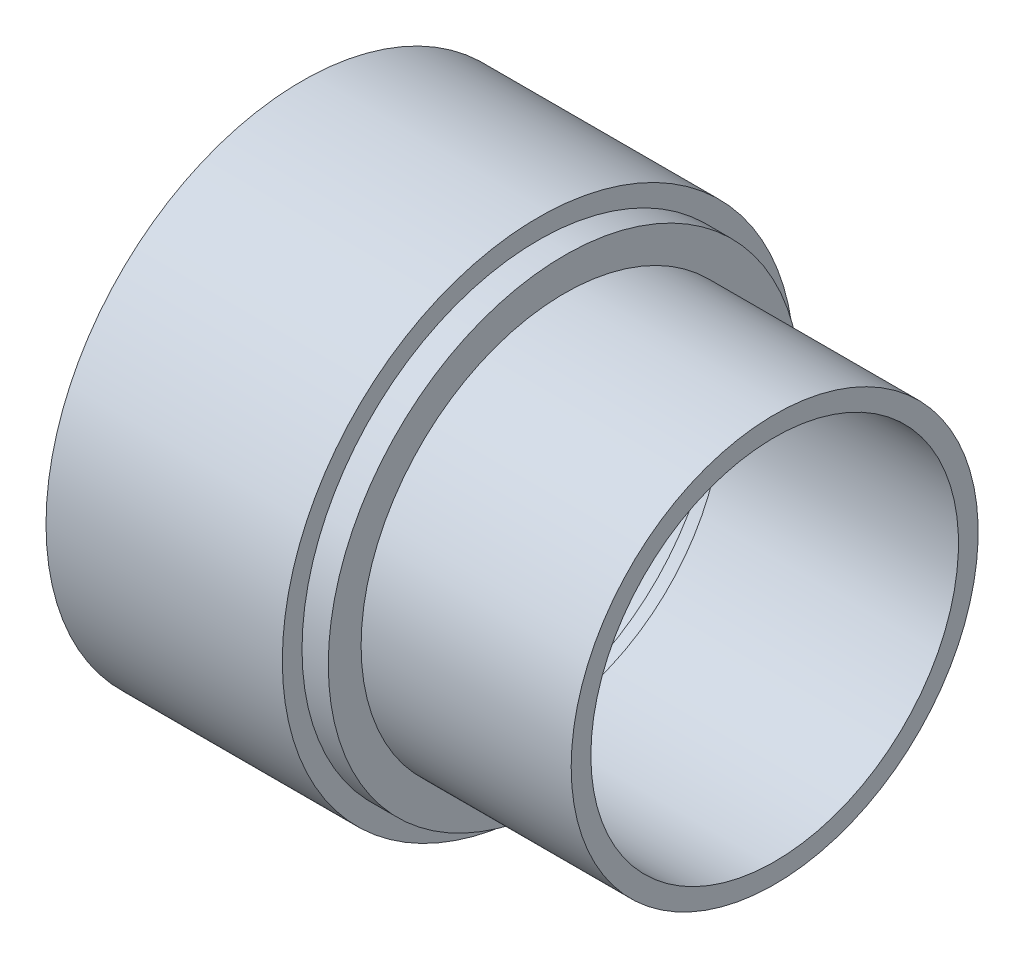
ISO-10303-21;
HEADER;
FILE_DESCRIPTION(('STEP AP214'),'2;1');
FILE_NAME('part.step','',(''),(''),'','','');
FILE_SCHEMA(('AUTOMOTIVE_DESIGN { 1 0 10303 214 1 1 1 1 }'));
ENDSEC;
DATA;
#1=APPLICATION_CONTEXT('core data for automotive mechanical design processes');
#2=APPLICATION_PROTOCOL_DEFINITION('international standard','automotive_design',2000,#1);
#3=PRODUCT_CONTEXT('',#1,'mechanical');
#4=PRODUCT('Part','Part','',(#3));
#5=PRODUCT_RELATED_PRODUCT_CATEGORY('part','',(#4));
#6=PRODUCT_DEFINITION_FORMATION('','',#4);
#7=PRODUCT_DEFINITION_CONTEXT('part definition',#1,'design');
#8=PRODUCT_DEFINITION('design','',#6,#7);
#9=PRODUCT_DEFINITION_SHAPE('','',#8);
#10=(LENGTH_UNIT() NAMED_UNIT(*) SI_UNIT(.MILLI.,.METRE.));
#11=(NAMED_UNIT(*) PLANE_ANGLE_UNIT() SI_UNIT($,.RADIAN.));
#12=(NAMED_UNIT(*) SI_UNIT($,.STERADIAN.) SOLID_ANGLE_UNIT());
#13=UNCERTAINTY_MEASURE_WITH_UNIT(LENGTH_MEASURE(1.E-05),#10,'distance_accuracy_value','');
#14=(GEOMETRIC_REPRESENTATION_CONTEXT(3) GLOBAL_UNCERTAINTY_ASSIGNED_CONTEXT((#13)) GLOBAL_UNIT_ASSIGNED_CONTEXT((#10,
#11,#12)) REPRESENTATION_CONTEXT('',''));
#15=CARTESIAN_POINT('',(0.,0.,0.));
#16=DIRECTION('',(0.,0.,1.));
#17=DIRECTION('',(1.,0.,0.));
#18=AXIS2_PLACEMENT_3D('',#15,#16,#17);
#19=CARTESIAN_POINT('',(0.,49.2125,0.));
#20=DIRECTION('',(1.,0.,0.));
#21=DIRECTION('',(0.,0.,-1.));
#22=AXIS2_PLACEMENT_3D('',#19,#20,#21);
#23=PLANE('',#22);
#24=CARTESIAN_POINT('',(0.,0.,0.));
#25=DIRECTION('',(-1.,0.,0.));
#26=DIRECTION('',(0.,0.,1.));
#27=AXIS2_PLACEMENT_3D('',#24,#25,#26);
#28=CIRCLE('',#27,44.45);
#29=CARTESIAN_POINT('',(0.,0.,44.45));
#30=VERTEX_POINT('',#29);
#31=EDGE_CURVE('E11',#30,#30,#28,.T.);
#32=ORIENTED_EDGE('',*,*,#31,.F.);
#33=EDGE_LOOP('',(#32));
#34=FACE_BOUND('',#33,.T.);
#35=CARTESIAN_POINT('',(0.,0.,0.));
#36=DIRECTION('',(-1.,0.,0.));
#37=DIRECTION('',(0.,0.,1.));
#38=AXIS2_PLACEMENT_3D('',#35,#36,#37);
#39=CIRCLE('',#38,49.2125);
#40=CARTESIAN_POINT('',(0.,0.,49.2125));
#41=VERTEX_POINT('',#40);
#42=EDGE_CURVE('E62',#41,#41,#39,.T.);
#43=ORIENTED_EDGE('',*,*,#42,.T.);
#44=EDGE_LOOP('',(#43));
#45=FACE_BOUND('',#44,.T.);
#46=ADVANCED_FACE('F48',(#34,#45),#23,.F.);
#47=CARTESIAN_POINT('',(0.,0.,0.));
#48=DIRECTION('',(-1.,0.,0.));
#49=DIRECTION('',(0.,0.,1.));
#50=AXIS2_PLACEMENT_3D('',#47,#48,#49);
#51=CYLINDRICAL_SURFACE('',#50,44.45);
#52=CARTESIAN_POINT('',(57.15,0.,0.));
#53=DIRECTION('',(-1.,0.,0.));
#54=DIRECTION('',(0.,0.,1.));
#55=AXIS2_PLACEMENT_3D('',#52,#53,#54);
#56=CIRCLE('',#55,44.45);
#57=CARTESIAN_POINT('',(57.15,0.,44.45));
#58=VERTEX_POINT('',#57);
#59=EDGE_CURVE('E54',#58,#58,#56,.T.);
#60=ORIENTED_EDGE('',*,*,#59,.F.);
#61=EDGE_LOOP('',(#60));
#62=FACE_BOUND('',#61,.T.);
#63=ORIENTED_EDGE('',*,*,#31,.T.);
#64=EDGE_LOOP('',(#63));
#65=FACE_BOUND('',#64,.T.);
#66=ADVANCED_FACE('F77',(#62,#65),#51,.F.);
#67=CARTESIAN_POINT('',(57.15,49.2125,0.));
#68=DIRECTION('',(-1.,0.,0.));
#69=DIRECTION('',(0.,0.,1.));
#70=AXIS2_PLACEMENT_3D('',#67,#68,#69);
#71=PLANE('',#70);
#72=CARTESIAN_POINT('',(57.15,0.,0.));
#73=DIRECTION('',(-1.,0.,0.));
#74=DIRECTION('',(0.,0.,1.));
#75=AXIS2_PLACEMENT_3D('',#72,#73,#74);
#76=CIRCLE('',#75,49.2125);
#77=CARTESIAN_POINT('',(57.15,0.,49.2125));
#78=VERTEX_POINT('',#77);
#79=EDGE_CURVE('E58',#78,#78,#76,.T.);
#80=ORIENTED_EDGE('',*,*,#79,.F.);
#81=EDGE_LOOP('',(#80));
#82=FACE_BOUND('',#81,.T.);
#83=ORIENTED_EDGE('',*,*,#59,.T.);
#84=EDGE_LOOP('',(#83));
#85=FACE_BOUND('',#84,.T.);
#86=ADVANCED_FACE('F72',(#82,#85),#71,.F.);
#87=CARTESIAN_POINT('',(0.,0.,0.));
#88=DIRECTION('',(-1.,0.,0.));
#89=DIRECTION('',(0.,0.,1.));
#90=AXIS2_PLACEMENT_3D('',#87,#88,#89);
#91=CYLINDRICAL_SURFACE('',#90,49.2125);
#92=ORIENTED_EDGE('',*,*,#42,.F.);
#93=EDGE_LOOP('',(#92));
#94=FACE_BOUND('',#93,.T.);
#95=ORIENTED_EDGE('',*,*,#79,.T.);
#96=EDGE_LOOP('',(#95));
#97=FACE_BOUND('',#96,.T.);
#98=ADVANCED_FACE('F69',(#94,#97),#91,.T.);
#99=CLOSED_SHELL('',(#46,#66,#86,#98));
#100=MANIFOLD_SOLID_BREP('B2',#99);
#101=CARTESIAN_POINT('',(0.,57.15,0.));
#102=DIRECTION('',(-1.,0.,0.));
#103=DIRECTION('',(0.,0.,1.));
#104=AXIS2_PLACEMENT_3D('',#101,#102,#103);
#105=PLANE('',#104);
#106=CARTESIAN_POINT('',(0.,0.,0.));
#107=DIRECTION('',(-1.,0.,0.));
#108=DIRECTION('',(0.,0.,1.));
#109=AXIS2_PLACEMENT_3D('',#106,#107,#108);
#110=CIRCLE('',#109,61.9125);
#111=CARTESIAN_POINT('',(0.,0.,61.9125));
#112=VERTEX_POINT('',#111);
#113=EDGE_CURVE('E47',#112,#112,#110,.T.);
#114=ORIENTED_EDGE('',*,*,#113,.F.);
#115=EDGE_LOOP('',(#114));
#116=FACE_BOUND('',#115,.T.);
#117=CARTESIAN_POINT('',(0.,0.,0.));
#118=DIRECTION('',(-1.,0.,0.));
#119=DIRECTION('',(0.,0.,1.));
#120=AXIS2_PLACEMENT_3D('',#117,#118,#119);
#121=CIRCLE('',#120,57.15);
#122=CARTESIAN_POINT('',(0.,0.,57.15));
#123=VERTEX_POINT('',#122);
#124=EDGE_CURVE('E134',#123,#123,#121,.T.);
#125=ORIENTED_EDGE('',*,*,#124,.T.);
#126=EDGE_LOOP('',(#125));
#127=FACE_BOUND('',#126,.T.);
#128=ADVANCED_FACE('F117',(#116,#127),#105,.F.);
#129=CARTESIAN_POINT('',(0.,0.,0.));
#130=DIRECTION('',(-1.,0.,0.));
#131=DIRECTION('',(0.,0.,1.));
#132=AXIS2_PLACEMENT_3D('',#129,#130,#131);
#133=CYLINDRICAL_SURFACE('',#132,61.9125);
#134=CARTESIAN_POINT('',(-57.15,0.,0.));
#135=DIRECTION('',(-1.,0.,0.));
#136=DIRECTION('',(0.,0.,1.));
#137=AXIS2_PLACEMENT_3D('',#134,#135,#136);
#138=CIRCLE('',#137,61.9125);
#139=CARTESIAN_POINT('',(-57.15,0.,61.9125));
#140=VERTEX_POINT('',#139);
#141=EDGE_CURVE('E124',#140,#140,#138,.T.);
#142=ORIENTED_EDGE('',*,*,#141,.F.);
#143=EDGE_LOOP('',(#142));
#144=FACE_BOUND('',#143,.T.);
#145=ORIENTED_EDGE('',*,*,#113,.T.);
#146=EDGE_LOOP('',(#145));
#147=FACE_BOUND('',#146,.T.);
#148=ADVANCED_FACE('F150',(#144,#147),#133,.T.);
#149=CARTESIAN_POINT('',(-57.15,57.15,0.));
#150=DIRECTION('',(1.,0.,0.));
#151=DIRECTION('',(0.,0.,-1.));
#152=AXIS2_PLACEMENT_3D('',#149,#150,#151);
#153=PLANE('',#152);
#154=CARTESIAN_POINT('',(-57.15,0.,0.));
#155=DIRECTION('',(-1.,0.,0.));
#156=DIRECTION('',(0.,0.,1.));
#157=AXIS2_PLACEMENT_3D('',#154,#155,#156);
#158=CIRCLE('',#157,57.15);
#159=CARTESIAN_POINT('',(-57.15,0.,57.15));
#160=VERTEX_POINT('',#159);
#161=EDGE_CURVE('E129',#160,#160,#158,.T.);
#162=ORIENTED_EDGE('',*,*,#161,.F.);
#163=EDGE_LOOP('',(#162));
#164=FACE_BOUND('',#163,.T.);
#165=ORIENTED_EDGE('',*,*,#141,.T.);
#166=EDGE_LOOP('',(#165));
#167=FACE_BOUND('',#166,.T.);
#168=ADVANCED_FACE('F145',(#164,#167),#153,.F.);
#169=CARTESIAN_POINT('',(0.,0.,0.));
#170=DIRECTION('',(-1.,0.,0.));
#171=DIRECTION('',(0.,0.,1.));
#172=AXIS2_PLACEMENT_3D('',#169,#170,#171);
#173=CYLINDRICAL_SURFACE('',#172,57.15);
#174=ORIENTED_EDGE('',*,*,#124,.F.);
#175=EDGE_LOOP('',(#174));
#176=FACE_BOUND('',#175,.T.);
#177=ORIENTED_EDGE('',*,*,#161,.T.);
#178=EDGE_LOOP('',(#177));
#179=FACE_BOUND('',#178,.T.);
#180=ADVANCED_FACE('F142',(#176,#179),#173,.F.);
#181=CLOSED_SHELL('',(#128,#148,#168,#180));
#182=MANIFOLD_SOLID_BREP('B6',#181);
#183=CARTESIAN_POINT('',(6.35,57.15,0.));
#184=DIRECTION('',(-1.,0.,0.));
#185=DIRECTION('',(0.,0.,1.));
#186=AXIS2_PLACEMENT_3D('',#183,#184,#185);
#187=PLANE('',#186);
#188=CARTESIAN_POINT('',(6.35,0.,0.));
#189=DIRECTION('',(-1.,0.,0.));
#190=DIRECTION('',(0.,0.,1.));
#191=AXIS2_PLACEMENT_3D('',#188,#189,#190);
#192=CIRCLE('',#191,57.15);
#193=CARTESIAN_POINT('',(6.35,0.,57.15));
#194=VERTEX_POINT('',#193);
#195=EDGE_CURVE('E197',#194,#194,#192,.T.);
#196=ORIENTED_EDGE('',*,*,#195,.F.);
#197=EDGE_LOOP('',(#196));
#198=FACE_BOUND('',#197,.T.);
#199=CARTESIAN_POINT('',(6.35,0.,0.));
#200=DIRECTION('',(-1.,0.,0.));
#201=DIRECTION('',(0.,0.,1.));
#202=AXIS2_PLACEMENT_3D('',#199,#200,#201);
#203=CIRCLE('',#202,49.2125);
#204=CARTESIAN_POINT('',(6.35,0.,49.2125));
#205=VERTEX_POINT('',#204);
#206=EDGE_CURVE('E116',#205,#205,#203,.T.);
#207=ORIENTED_EDGE('',*,*,#206,.T.);
#208=EDGE_LOOP('',(#207));
#209=FACE_BOUND('',#208,.T.);
#210=ADVANCED_FACE('F183',(#198,#209),#187,.F.);
#211=CARTESIAN_POINT('',(0.,0.,0.));
#212=DIRECTION('',(-1.,0.,0.));
#213=DIRECTION('',(0.,0.,1.));
#214=AXIS2_PLACEMENT_3D('',#211,#212,#213);
#215=CYLINDRICAL_SURFACE('',#214,49.2125);
#216=ORIENTED_EDGE('',*,*,#206,.F.);
#217=EDGE_LOOP('',(#216));
#218=FACE_BOUND('',#217,.T.);
#219=CARTESIAN_POINT('',(-6.35,0.,0.));
#220=DIRECTION('',(-1.,0.,0.));
#221=DIRECTION('',(0.,0.,1.));
#222=AXIS2_PLACEMENT_3D('',#219,#220,#221);
#223=CIRCLE('',#222,49.2125);
#224=CARTESIAN_POINT('',(-6.35,0.,49.2125));
#225=VERTEX_POINT('',#224);
#226=EDGE_CURVE('E189',#225,#225,#223,.T.);
#227=ORIENTED_EDGE('',*,*,#226,.T.);
#228=EDGE_LOOP('',(#227));
#229=FACE_BOUND('',#228,.T.);
#230=ADVANCED_FACE('F206',(#218,#229),#215,.F.);
#231=CARTESIAN_POINT('',(-6.35,57.15,0.));
#232=DIRECTION('',(1.,0.,0.));
#233=DIRECTION('',(0.,0.,-1.));
#234=AXIS2_PLACEMENT_3D('',#231,#232,#233);
#235=PLANE('',#234);
#236=ORIENTED_EDGE('',*,*,#226,.F.);
#237=EDGE_LOOP('',(#236));
#238=FACE_BOUND('',#237,.T.);
#239=CARTESIAN_POINT('',(-6.35,0.,0.));
#240=DIRECTION('',(-1.,0.,0.));
#241=DIRECTION('',(0.,0.,1.));
#242=AXIS2_PLACEMENT_3D('',#239,#240,#241);
#243=CIRCLE('',#242,57.15);
#244=CARTESIAN_POINT('',(-6.35,0.,57.15));
#245=VERTEX_POINT('',#244);
#246=EDGE_CURVE('E193',#245,#245,#243,.T.);
#247=ORIENTED_EDGE('',*,*,#246,.T.);
#248=EDGE_LOOP('',(#247));
#249=FACE_BOUND('',#248,.T.);
#250=ADVANCED_FACE('F210',(#238,#249),#235,.F.);
#251=CARTESIAN_POINT('',(0.,0.,0.));
#252=DIRECTION('',(-1.,0.,0.));
#253=DIRECTION('',(0.,0.,1.));
#254=AXIS2_PLACEMENT_3D('',#251,#252,#253);
#255=CYLINDRICAL_SURFACE('',#254,57.15);
#256=ORIENTED_EDGE('',*,*,#246,.F.);
#257=EDGE_LOOP('',(#256));
#258=FACE_BOUND('',#257,.T.);
#259=ORIENTED_EDGE('',*,*,#195,.T.);
#260=EDGE_LOOP('',(#259));
#261=FACE_BOUND('',#260,.T.);
#262=ADVANCED_FACE('F203',(#258,#261),#255,.T.);
#263=CLOSED_SHELL('',(#210,#230,#250,#262));
#264=MANIFOLD_SOLID_BREP('B42',#263);
#265=ADVANCED_BREP_SHAPE_REPRESENTATION('',(#18,#100,#182,#264),#14);
#266=SHAPE_DEFINITION_REPRESENTATION(#9,#265);
ENDSEC;
END-ISO-10303-21;
